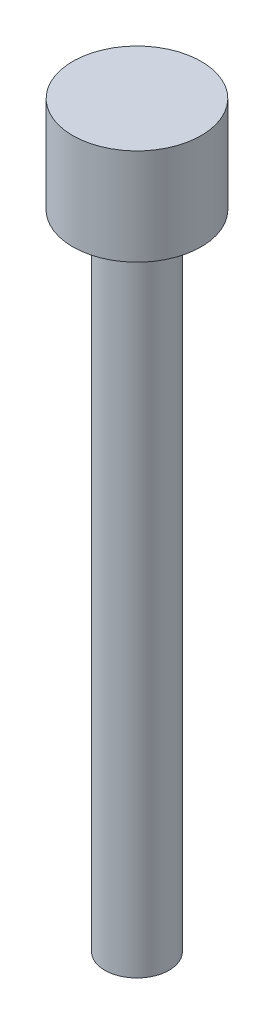
ISO-10303-21;
HEADER;
FILE_DESCRIPTION(('STEP AP214'),'2;1');
FILE_NAME('part.step','',(''),(''),'','','');
FILE_SCHEMA(('AUTOMOTIVE_DESIGN { 1 0 10303 214 1 1 1 1 }'));
ENDSEC;
DATA;
#1=APPLICATION_CONTEXT('core data for automotive mechanical design processes');
#2=APPLICATION_PROTOCOL_DEFINITION('international standard','automotive_design',2000,#1);
#3=PRODUCT_CONTEXT('',#1,'mechanical');
#4=PRODUCT('Part','Part','',(#3));
#5=PRODUCT_RELATED_PRODUCT_CATEGORY('part','',(#4));
#6=PRODUCT_DEFINITION_FORMATION('','',#4);
#7=PRODUCT_DEFINITION_CONTEXT('part definition',#1,'design');
#8=PRODUCT_DEFINITION('design','',#6,#7);
#9=PRODUCT_DEFINITION_SHAPE('','',#8);
#10=(LENGTH_UNIT() NAMED_UNIT(*) SI_UNIT(.MILLI.,.METRE.));
#11=(NAMED_UNIT(*) PLANE_ANGLE_UNIT() SI_UNIT($,.RADIAN.));
#12=(NAMED_UNIT(*) SI_UNIT($,.STERADIAN.) SOLID_ANGLE_UNIT());
#13=UNCERTAINTY_MEASURE_WITH_UNIT(LENGTH_MEASURE(1.E-05),#10,'distance_accuracy_value','');
#14=(GEOMETRIC_REPRESENTATION_CONTEXT(3) GLOBAL_UNCERTAINTY_ASSIGNED_CONTEXT((#13)) GLOBAL_UNIT_ASSIGNED_CONTEXT((#10,
#11,#12)) REPRESENTATION_CONTEXT('',''));
#15=CARTESIAN_POINT('',(0.,0.,0.));
#16=DIRECTION('',(0.,0.,1.));
#17=DIRECTION('',(1.,0.,0.));
#18=AXIS2_PLACEMENT_3D('',#15,#16,#17);
#19=CARTESIAN_POINT('',(0.,3.000000096,0.));
#20=DIRECTION('',(0.,-1.,0.));
#21=DIRECTION('',(0.,0.,-1.));
#22=AXIS2_PLACEMENT_3D('',#19,#20,#21);
#23=CYLINDRICAL_SURFACE('',#22,2.000000064);
#24=CARTESIAN_POINT('',(0.,3.000000096,0.));
#25=DIRECTION('',(0.,1.,0.));
#26=DIRECTION('',(0.,0.,1.));
#27=AXIS2_PLACEMENT_3D('',#24,#25,#26);
#28=CIRCLE('',#27,2.000000064);
#29=CARTESIAN_POINT('',(0.,3.000000096,2.000000064));
#30=VERTEX_POINT('',#29);
#31=EDGE_CURVE('E10',#30,#30,#28,.T.);
#32=ORIENTED_EDGE('',*,*,#31,.F.);
#33=EDGE_LOOP('',(#32));
#34=FACE_BOUND('',#33,.T.);
#35=CARTESIAN_POINT('',(0.,0.,0.));
#36=DIRECTION('',(0.,1.,0.));
#37=DIRECTION('',(0.,0.,1.));
#38=AXIS2_PLACEMENT_3D('',#35,#36,#37);
#39=CIRCLE('',#38,2.000000064);
#40=CARTESIAN_POINT('',(0.,0.,2.000000064));
#41=VERTEX_POINT('',#40);
#42=EDGE_CURVE('E38',#41,#41,#39,.T.);
#43=ORIENTED_EDGE('',*,*,#42,.T.);
#44=EDGE_LOOP('',(#43));
#45=FACE_BOUND('',#44,.T.);
#46=ADVANCED_FACE('F35',(#34,#45),#23,.T.);
#47=CARTESIAN_POINT('',(0.,3.000000096,0.));
#48=DIRECTION('',(0.,1.,0.));
#49=DIRECTION('',(0.,0.,1.));
#50=AXIS2_PLACEMENT_3D('',#47,#48,#49);
#51=PLANE('',#50);
#52=ORIENTED_EDGE('',*,*,#31,.T.);
#53=EDGE_LOOP('',(#52));
#54=FACE_BOUND('',#53,.T.);
#55=ADVANCED_FACE('F65',(#54),#51,.T.);
#56=CARTESIAN_POINT('',(0.,0.,0.));
#57=DIRECTION('',(0.,1.,0.));
#58=DIRECTION('',(0.,0.,1.));
#59=AXIS2_PLACEMENT_3D('',#56,#57,#58);
#60=PLANE('',#59);
#61=CARTESIAN_POINT('',(0.,0.,0.));
#62=DIRECTION('',(0.,1.,0.));
#63=DIRECTION('',(0.,0.,1.));
#64=AXIS2_PLACEMENT_3D('',#61,#62,#63);
#65=CIRCLE('',#64,1.000000032);
#66=CARTESIAN_POINT('',(0.,0.,1.000000032));
#67=VERTEX_POINT('',#66);
#68=EDGE_CURVE('E47',#67,#67,#65,.T.);
#69=ORIENTED_EDGE('',*,*,#68,.T.);
#70=EDGE_LOOP('',(#69));
#71=FACE_BOUND('',#70,.T.);
#72=ORIENTED_EDGE('',*,*,#42,.F.);
#73=EDGE_LOOP('',(#72));
#74=FACE_BOUND('',#73,.T.);
#75=ADVANCED_FACE('F62',(#71,#74),#60,.F.);
#76=CARTESIAN_POINT('',(0.,-19.999999878,0.));
#77=DIRECTION('',(0.,1.,0.));
#78=DIRECTION('',(0.,0.,1.));
#79=AXIS2_PLACEMENT_3D('',#76,#77,#78);
#80=CYLINDRICAL_SURFACE('',#79,1.000000032);
#81=CARTESIAN_POINT('',(0.,-19.999999878,0.));
#82=DIRECTION('',(0.,1.,0.));
#83=DIRECTION('',(0.,0.,1.));
#84=AXIS2_PLACEMENT_3D('',#81,#82,#83);
#85=CIRCLE('',#84,1.000000032);
#86=CARTESIAN_POINT('',(0.,-19.999999878,1.000000032));
#87=VERTEX_POINT('',#86);
#88=EDGE_CURVE('E45',#87,#87,#85,.T.);
#89=ORIENTED_EDGE('',*,*,#88,.T.);
#90=EDGE_LOOP('',(#89));
#91=FACE_BOUND('',#90,.T.);
#92=ORIENTED_EDGE('',*,*,#68,.F.);
#93=EDGE_LOOP('',(#92));
#94=FACE_BOUND('',#93,.T.);
#95=ADVANCED_FACE('F53',(#91,#94),#80,.T.);
#96=CARTESIAN_POINT('',(0.,-19.999999878,0.));
#97=DIRECTION('',(0.,1.,0.));
#98=DIRECTION('',(0.,0.,1.));
#99=AXIS2_PLACEMENT_3D('',#96,#97,#98);
#100=PLANE('',#99);
#101=ORIENTED_EDGE('',*,*,#88,.F.);
#102=EDGE_LOOP('',(#101));
#103=FACE_BOUND('',#102,.T.);
#104=ADVANCED_FACE('F56',(#103),#100,.F.);
#105=CLOSED_SHELL('',(#46,#55,#75,#95,#104));
#106=MANIFOLD_SOLID_BREP('B2',#105);
#107=ADVANCED_BREP_SHAPE_REPRESENTATION('',(#18,#106),#14);
#108=SHAPE_DEFINITION_REPRESENTATION(#9,#107);
ENDSEC;
END-ISO-10303-21;
